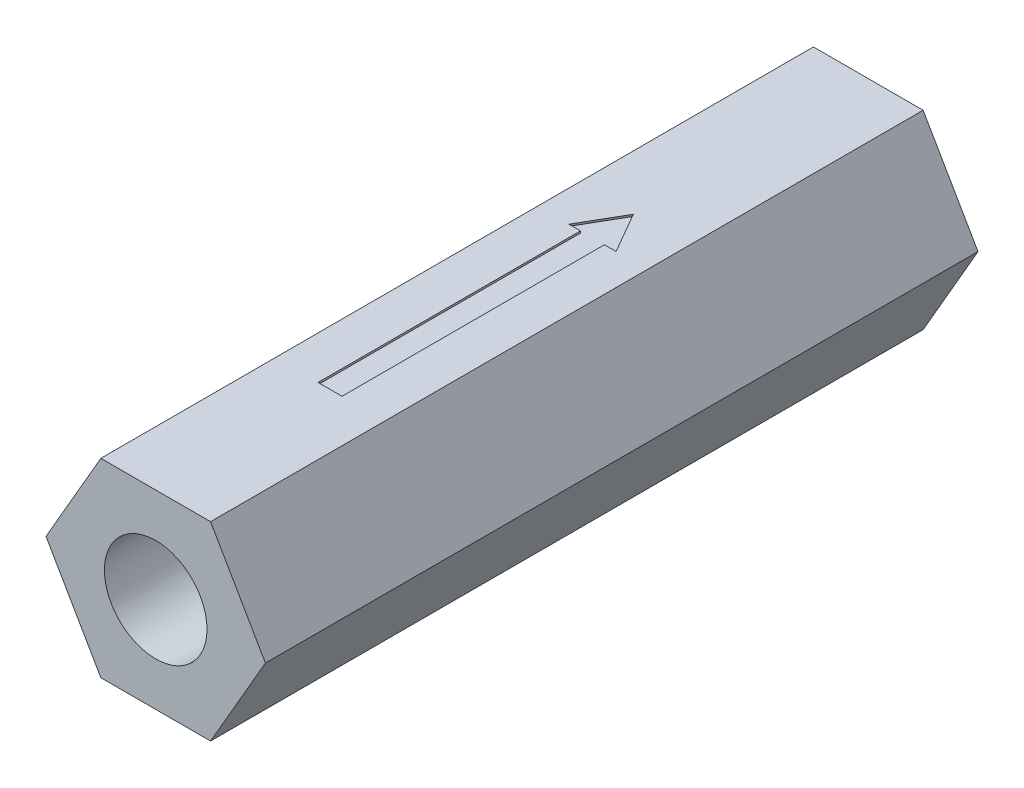
ISO-10303-21;
HEADER;
FILE_DESCRIPTION(('STEP AP214'),'2;1');
FILE_NAME('part.step','',(''),(''),'','','');
FILE_SCHEMA(('AUTOMOTIVE_DESIGN { 1 0 10303 214 1 1 1 1 }'));
ENDSEC;
DATA;
#1=APPLICATION_CONTEXT('core data for automotive mechanical design processes');
#2=APPLICATION_PROTOCOL_DEFINITION('international standard','automotive_design',2000,#1);
#3=PRODUCT_CONTEXT('',#1,'mechanical');
#4=PRODUCT('Part','Part','',(#3));
#5=PRODUCT_RELATED_PRODUCT_CATEGORY('part','',(#4));
#6=PRODUCT_DEFINITION_FORMATION('','',#4);
#7=PRODUCT_DEFINITION_CONTEXT('part definition',#1,'design');
#8=PRODUCT_DEFINITION('design','',#6,#7);
#9=PRODUCT_DEFINITION_SHAPE('','',#8);
#10=(LENGTH_UNIT() NAMED_UNIT(*) SI_UNIT(.MILLI.,.METRE.));
#11=(NAMED_UNIT(*) PLANE_ANGLE_UNIT() SI_UNIT($,.RADIAN.));
#12=(NAMED_UNIT(*) SI_UNIT($,.STERADIAN.) SOLID_ANGLE_UNIT());
#13=UNCERTAINTY_MEASURE_WITH_UNIT(LENGTH_MEASURE(1.E-05),#10,'distance_accuracy_value','');
#14=(GEOMETRIC_REPRESENTATION_CONTEXT(3) GLOBAL_UNCERTAINTY_ASSIGNED_CONTEXT((#13)) GLOBAL_UNIT_ASSIGNED_CONTEXT((#10,
#11,#12)) REPRESENTATION_CONTEXT('',''));
#15=CARTESIAN_POINT('',(0.,0.,0.));
#16=DIRECTION('',(0.,0.,1.));
#17=DIRECTION('',(1.,0.,0.));
#18=AXIS2_PLACEMENT_3D('',#15,#16,#17);
#19=CARTESIAN_POINT('',(7.3323484187084,-12.6999999999999,95.25));
#20=DIRECTION('',(-0.866025403784441,0.499999999999995,0.));
#21=DIRECTION('',(-0.499999999999995,-0.866025403784442,0.));
#22=AXIS2_PLACEMENT_3D('',#19,#20,#21);
#23=PLANE('',#22);
#24=DIRECTION('',(0.499999999999995,0.866025403784442,0.));
#25=VECTOR('',#24,1.);
#26=CARTESIAN_POINT('',(7.3323484187084,-12.6999999999999,0.));
#27=LINE('',#26,#25);
#28=CARTESIAN_POINT('',(7.3323484187084,-12.6999999999999,0.));
#29=VERTEX_POINT('',#28);
#30=CARTESIAN_POINT('',(14.6646968374165,0.,0.));
#31=VERTEX_POINT('',#30);
#32=EDGE_CURVE('E132',#29,#31,#27,.T.);
#33=ORIENTED_EDGE('',*,*,#32,.T.);
#34=DIRECTION('',(0.,0.,-1.));
#35=VECTOR('',#34,1.);
#36=CARTESIAN_POINT('',(14.6646968374165,0.,95.25));
#37=LINE('',#36,#35);
#38=CARTESIAN_POINT('',(14.6646968374165,0.,95.25));
#39=VERTEX_POINT('',#38);
#40=EDGE_CURVE('E11',#39,#31,#37,.T.);
#41=ORIENTED_EDGE('',*,*,#40,.F.);
#42=DIRECTION('',(0.499999999999995,0.866025403784442,0.));
#43=VECTOR('',#42,1.);
#44=CARTESIAN_POINT('',(7.3323484187084,-12.6999999999999,95.25));
#45=LINE('',#44,#43);
#46=CARTESIAN_POINT('',(7.3323484187084,-12.6999999999999,95.25));
#47=VERTEX_POINT('',#46);
#48=EDGE_CURVE('E144',#47,#39,#45,.T.);
#49=ORIENTED_EDGE('',*,*,#48,.F.);
#50=DIRECTION('',(0.,0.,-1.));
#51=VECTOR('',#50,1.);
#52=CARTESIAN_POINT('',(7.3323484187084,-12.6999999999999,95.25));
#53=LINE('',#52,#51);
#54=EDGE_CURVE('E128',#47,#29,#53,.T.);
#55=ORIENTED_EDGE('',*,*,#54,.T.);
#56=EDGE_LOOP('',(#33,#41,#49,#55));
#57=FACE_BOUND('',#56,.T.);
#58=ADVANCED_FACE('F36',(#57),#23,.F.);
#59=CARTESIAN_POINT('',(14.6646968374165,0.,95.25));
#60=DIRECTION('',(-0.866025403784438,-0.500000000000001,0.));
#61=DIRECTION('',(0.500000000000001,-0.866025403784438,0.));
#62=AXIS2_PLACEMENT_3D('',#59,#60,#61);
#63=PLANE('',#62);
#64=DIRECTION('',(-0.500000000000001,0.866025403784438,0.));
#65=VECTOR('',#64,1.);
#66=CARTESIAN_POINT('',(14.6646968374165,0.,0.));
#67=LINE('',#66,#65);
#68=CARTESIAN_POINT('',(7.33234841870822,12.7,0.));
#69=VERTEX_POINT('',#68);
#70=EDGE_CURVE('E135',#31,#69,#67,.T.);
#71=ORIENTED_EDGE('',*,*,#70,.T.);
#72=DIRECTION('',(0.,0.,-1.));
#73=VECTOR('',#72,1.);
#74=CARTESIAN_POINT('',(7.33234841870822,12.7,95.25));
#75=LINE('',#74,#73);
#76=CARTESIAN_POINT('',(7.33234841870822,12.7,95.25));
#77=VERTEX_POINT('',#76);
#78=EDGE_CURVE('E43',#77,#69,#75,.T.);
#79=ORIENTED_EDGE('',*,*,#78,.F.);
#80=DIRECTION('',(-0.500000000000001,0.866025403784438,0.));
#81=VECTOR('',#80,1.);
#82=CARTESIAN_POINT('',(14.6646968374165,0.,95.25));
#83=LINE('',#82,#81);
#84=EDGE_CURVE('E94',#39,#77,#83,.T.);
#85=ORIENTED_EDGE('',*,*,#84,.F.);
#86=ORIENTED_EDGE('',*,*,#40,.T.);
#87=EDGE_LOOP('',(#71,#79,#85,#86));
#88=FACE_BOUND('',#87,.T.);
#89=ADVANCED_FACE('F296',(#88),#63,.F.);
#90=CARTESIAN_POINT('',(7.33234841870822,12.7,95.25));
#91=DIRECTION('',(0.,-1.,0.));
#92=DIRECTION('',(1.,0.,0.));
#93=AXIS2_PLACEMENT_3D('',#90,#91,#92);
#94=PLANE('',#93);
#95=DIRECTION('',(0.,0.,1.));
#96=VECTOR('',#95,1.);
#97=CARTESIAN_POINT('',(-1.60045154196813,12.7,71.9490671710865));
#98=LINE('',#97,#96);
#99=CARTESIAN_POINT('',(-1.60045154196813,12.7,36.8665670362898));
#100=VERTEX_POINT('',#99);
#101=CARTESIAN_POINT('',(-1.60045154196813,12.7,71.9490671710865));
#102=VERTEX_POINT('',#101);
#103=EDGE_CURVE('E208',#100,#102,#98,.T.);
#104=ORIENTED_EDGE('',*,*,#103,.F.);
#105=DIRECTION('',(1.,0.,0.));
#106=VECTOR('',#105,1.);
#107=CARTESIAN_POINT('',(-3.153270171135,12.7,36.8665670362898));
#108=LINE('',#107,#106);
#109=CARTESIAN_POINT('',(-3.153270171135,12.7,36.8665670362898));
#110=VERTEX_POINT('',#109);
#111=EDGE_CURVE('E50',#110,#100,#108,.T.);
#112=ORIENTED_EDGE('',*,*,#111,.F.);
#113=DIRECTION('',(-0.499999999999998,0.,0.86602540378444));
#114=VECTOR('',#113,1.);
#115=CARTESIAN_POINT('',(0.,12.7,31.4049428898926));
#116=LINE('',#115,#114);
#117=CARTESIAN_POINT('',(0.,12.7,31.4049428898926));
#118=VERTEX_POINT('',#117);
#119=EDGE_CURVE('E192',#118,#110,#116,.T.);
#120=ORIENTED_EDGE('',*,*,#119,.F.);
#121=DIRECTION('',(-0.500000000000004,0.,-0.866025403784436));
#122=VECTOR('',#121,1.);
#123=CARTESIAN_POINT('',(3.15327017113494,12.7,36.8665670362897));
#124=LINE('',#123,#122);
#125=CARTESIAN_POINT('',(3.15327017113494,12.7,36.8665670362897));
#126=VERTEX_POINT('',#125);
#127=EDGE_CURVE('E196',#126,#118,#124,.T.);
#128=ORIENTED_EDGE('',*,*,#127,.F.);
#129=DIRECTION('',(1.,0.,0.));
#130=VECTOR('',#129,1.);
#131=CARTESIAN_POINT('',(1.60045154196804,12.7,36.8665670362897));
#132=LINE('',#131,#130);
#133=CARTESIAN_POINT('',(1.60045154196804,12.7,36.8665670362897));
#134=VERTEX_POINT('',#133);
#135=EDGE_CURVE('E199',#134,#126,#132,.T.);
#136=ORIENTED_EDGE('',*,*,#135,.F.);
#137=DIRECTION('',(0.,0.,-1.));
#138=VECTOR('',#137,1.);
#139=CARTESIAN_POINT('',(1.60045154196804,12.7,71.9490671710865));
#140=LINE('',#139,#138);
#141=CARTESIAN_POINT('',(1.60045154196804,12.7,71.9490671710865));
#142=VERTEX_POINT('',#141);
#143=EDGE_CURVE('E202',#142,#134,#140,.T.);
#144=ORIENTED_EDGE('',*,*,#143,.F.);
#145=DIRECTION('',(1.,0.,0.));
#146=VECTOR('',#145,1.);
#147=CARTESIAN_POINT('',(-1.60045154196813,12.7,71.9490671710865));
#148=LINE('',#147,#146);
#149=EDGE_CURVE('E205',#102,#142,#148,.T.);
#150=ORIENTED_EDGE('',*,*,#149,.F.);
#151=EDGE_LOOP('',(#104,#112,#120,#128,#136,#144,#150));
#152=FACE_BOUND('',#151,.T.);
#153=DIRECTION('',(-1.,0.,0.));
#154=VECTOR('',#153,1.);
#155=CARTESIAN_POINT('',(7.33234841870822,12.7,0.));
#156=LINE('',#155,#154);
#157=CARTESIAN_POINT('',(-7.33234841870831,12.7,0.));
#158=VERTEX_POINT('',#157);
#159=EDGE_CURVE('E138',#69,#158,#156,.T.);
#160=ORIENTED_EDGE('',*,*,#159,.T.);
#161=DIRECTION('',(0.,0.,-1.));
#162=VECTOR('',#161,1.);
#163=CARTESIAN_POINT('',(-7.33234841870831,12.7,95.25));
#164=LINE('',#163,#162);
#165=CARTESIAN_POINT('',(-7.33234841870831,12.7,95.25));
#166=VERTEX_POINT('',#165);
#167=EDGE_CURVE('E123',#166,#158,#164,.T.);
#168=ORIENTED_EDGE('',*,*,#167,.F.);
#169=DIRECTION('',(-1.,0.,0.));
#170=VECTOR('',#169,1.);
#171=CARTESIAN_POINT('',(7.33234841870822,12.7,95.25));
#172=LINE('',#171,#170);
#173=EDGE_CURVE('E111',#77,#166,#172,.T.);
#174=ORIENTED_EDGE('',*,*,#173,.F.);
#175=ORIENTED_EDGE('',*,*,#78,.T.);
#176=EDGE_LOOP('',(#160,#168,#174,#175));
#177=FACE_BOUND('',#176,.T.);
#178=ADVANCED_FACE('F150',(#152,#177),#94,.F.);
#179=CARTESIAN_POINT('',(-7.33234841870831,12.7,95.25));
#180=DIRECTION('',(0.866025403784441,-0.499999999999995,0.));
#181=DIRECTION('',(0.499999999999995,0.866025403784441,0.));
#182=AXIS2_PLACEMENT_3D('',#179,#180,#181);
#183=PLANE('',#182);
#184=DIRECTION('',(-0.499999999999995,-0.866025403784441,0.));
#185=VECTOR('',#184,1.);
#186=CARTESIAN_POINT('',(-7.33234841870831,12.7,0.));
#187=LINE('',#186,#185);
#188=CARTESIAN_POINT('',(-14.6646968374165,-1.02403030695263E-13,0.));
#189=VERTEX_POINT('',#188);
#190=EDGE_CURVE('E120',#158,#189,#187,.T.);
#191=ORIENTED_EDGE('',*,*,#190,.T.);
#192=DIRECTION('',(0.,0.,-1.));
#193=VECTOR('',#192,1.);
#194=CARTESIAN_POINT('',(-14.6646968374165,-1.02403030695263E-13,95.25));
#195=LINE('',#194,#193);
#196=CARTESIAN_POINT('',(-14.6646968374165,-1.02403030695263E-13,95.25));
#197=VERTEX_POINT('',#196);
#198=EDGE_CURVE('E117',#197,#189,#195,.T.);
#199=ORIENTED_EDGE('',*,*,#198,.F.);
#200=DIRECTION('',(-0.499999999999995,-0.866025403784441,0.));
#201=VECTOR('',#200,1.);
#202=CARTESIAN_POINT('',(-7.33234841870831,12.7,95.25));
#203=LINE('',#202,#201);
#204=EDGE_CURVE('E104',#166,#197,#203,.T.);
#205=ORIENTED_EDGE('',*,*,#204,.F.);
#206=ORIENTED_EDGE('',*,*,#167,.T.);
#207=EDGE_LOOP('',(#191,#199,#205,#206));
#208=FACE_BOUND('',#207,.T.);
#209=ADVANCED_FACE('F118',(#208),#183,.F.);
#210=CARTESIAN_POINT('',(-14.6646968374165,-1.02403030695263E-13,95.25));
#211=DIRECTION('',(0.866025403784434,0.500000000000007,0.));
#212=DIRECTION('',(-0.500000000000007,0.866025403784435,0.));
#213=AXIS2_PLACEMENT_3D('',#210,#211,#212);
#214=PLANE('',#213);
#215=DIRECTION('',(0.500000000000007,-0.866025403784435,0.));
#216=VECTOR('',#215,1.);
#217=CARTESIAN_POINT('',(-14.6646968374165,-1.02403030695263E-13,0.));
#218=LINE('',#217,#216);
#219=CARTESIAN_POINT('',(-7.33234841870814,-12.7000000000001,0.));
#220=VERTEX_POINT('',#219);
#221=EDGE_CURVE('E141',#189,#220,#218,.T.);
#222=ORIENTED_EDGE('',*,*,#221,.T.);
#223=DIRECTION('',(0.,0.,-1.));
#224=VECTOR('',#223,1.);
#225=CARTESIAN_POINT('',(-7.33234841870814,-12.7000000000001,95.25));
#226=LINE('',#225,#224);
#227=CARTESIAN_POINT('',(-7.33234841870814,-12.7000000000001,95.25));
#228=VERTEX_POINT('',#227);
#229=EDGE_CURVE('E124',#228,#220,#226,.T.);
#230=ORIENTED_EDGE('',*,*,#229,.F.);
#231=DIRECTION('',(0.500000000000007,-0.866025403784435,0.));
#232=VECTOR('',#231,1.);
#233=CARTESIAN_POINT('',(-14.6646968374165,-1.02403030695263E-13,95.25));
#234=LINE('',#233,#232);
#235=EDGE_CURVE('E108',#197,#228,#234,.T.);
#236=ORIENTED_EDGE('',*,*,#235,.F.);
#237=ORIENTED_EDGE('',*,*,#198,.T.);
#238=EDGE_LOOP('',(#222,#230,#236,#237));
#239=FACE_BOUND('',#238,.T.);
#240=ADVANCED_FACE('F126',(#239),#214,.F.);
#241=CARTESIAN_POINT('',(-7.33234841870814,-12.7000000000001,95.25));
#242=DIRECTION('',(0.,1.,0.));
#243=DIRECTION('',(-1.,0.,0.));
#244=AXIS2_PLACEMENT_3D('',#241,#242,#243);
#245=PLANE('',#244);
#246=DIRECTION('',(1.,0.,0.));
#247=VECTOR('',#246,1.);
#248=CARTESIAN_POINT('',(-7.33234841870814,-12.7000000000001,0.));
#249=LINE('',#248,#247);
#250=EDGE_CURVE('E86',#220,#29,#249,.T.);
#251=ORIENTED_EDGE('',*,*,#250,.T.);
#252=ORIENTED_EDGE('',*,*,#54,.F.);
#253=DIRECTION('',(1.,0.,0.));
#254=VECTOR('',#253,1.);
#255=CARTESIAN_POINT('',(-7.33234841870814,-12.7000000000001,95.25));
#256=LINE('',#255,#254);
#257=EDGE_CURVE('E59',#228,#47,#256,.T.);
#258=ORIENTED_EDGE('',*,*,#257,.F.);
#259=ORIENTED_EDGE('',*,*,#229,.T.);
#260=EDGE_LOOP('',(#251,#252,#258,#259));
#261=FACE_BOUND('',#260,.T.);
#262=ADVANCED_FACE('F154',(#261),#245,.F.);
#263=CARTESIAN_POINT('',(0.,0.,95.25));
#264=DIRECTION('',(0.,0.,1.));
#265=DIRECTION('',(1.,0.,0.));
#266=AXIS2_PLACEMENT_3D('',#263,#264,#265);
#267=PLANE('',#266);
#268=CARTESIAN_POINT('',(0.,0.,95.25));
#269=DIRECTION('',(0.,0.,1.));
#270=DIRECTION('',(1.,0.,0.));
#271=AXIS2_PLACEMENT_3D('',#268,#269,#270);
#272=CIRCLE('',#271,6.858);
#273=CARTESIAN_POINT('',(6.858,0.,95.25));
#274=VERTEX_POINT('',#273);
#275=EDGE_CURVE('E161',#274,#274,#272,.T.);
#276=ORIENTED_EDGE('',*,*,#275,.F.);
#277=EDGE_LOOP('',(#276));
#278=FACE_BOUND('',#277,.T.);
#279=ORIENTED_EDGE('',*,*,#48,.T.);
#280=ORIENTED_EDGE('',*,*,#84,.T.);
#281=ORIENTED_EDGE('',*,*,#173,.T.);
#282=ORIENTED_EDGE('',*,*,#204,.T.);
#283=ORIENTED_EDGE('',*,*,#235,.T.);
#284=ORIENTED_EDGE('',*,*,#257,.T.);
#285=EDGE_LOOP('',(#279,#280,#281,#282,#283,#284));
#286=FACE_BOUND('',#285,.T.);
#287=ADVANCED_FACE('F106',(#278,#286),#267,.T.);
#288=CARTESIAN_POINT('',(0.,0.,0.));
#289=DIRECTION('',(0.,0.,1.));
#290=DIRECTION('',(1.,0.,0.));
#291=AXIS2_PLACEMENT_3D('',#288,#289,#290);
#292=PLANE('',#291);
#293=CARTESIAN_POINT('',(0.,0.,0.));
#294=DIRECTION('',(0.,0.,-1.));
#295=DIRECTION('',(-1.,0.,0.));
#296=AXIS2_PLACEMENT_3D('',#293,#294,#295);
#297=CIRCLE('',#296,6.858);
#298=CARTESIAN_POINT('',(-6.858,0.,0.));
#299=VERTEX_POINT('',#298);
#300=EDGE_CURVE('E167',#299,#299,#297,.T.);
#301=ORIENTED_EDGE('',*,*,#300,.F.);
#302=EDGE_LOOP('',(#301));
#303=FACE_BOUND('',#302,.T.);
#304=ORIENTED_EDGE('',*,*,#32,.F.);
#305=ORIENTED_EDGE('',*,*,#250,.F.);
#306=ORIENTED_EDGE('',*,*,#221,.F.);
#307=ORIENTED_EDGE('',*,*,#190,.F.);
#308=ORIENTED_EDGE('',*,*,#159,.F.);
#309=ORIENTED_EDGE('',*,*,#70,.F.);
#310=EDGE_LOOP('',(#304,#305,#306,#307,#308,#309));
#311=FACE_BOUND('',#310,.T.);
#312=ADVANCED_FACE('F153',(#303,#311),#292,.F.);
#313=CARTESIAN_POINT('',(0.,0.,78.105));
#314=DIRECTION('',(0.,0.,1.));
#315=DIRECTION('',(1.,0.,0.));
#316=AXIS2_PLACEMENT_3D('',#313,#314,#315);
#317=CYLINDRICAL_SURFACE('',#316,6.858);
#318=CARTESIAN_POINT('',(0.,0.,78.105));
#319=DIRECTION('',(0.,0.,1.));
#320=DIRECTION('',(1.,0.,0.));
#321=AXIS2_PLACEMENT_3D('',#318,#319,#320);
#322=CIRCLE('',#321,6.858);
#323=CARTESIAN_POINT('',(6.858,0.,78.105));
#324=VERTEX_POINT('',#323);
#325=EDGE_CURVE('E136',#324,#324,#322,.T.);
#326=ORIENTED_EDGE('',*,*,#325,.F.);
#327=EDGE_LOOP('',(#326));
#328=FACE_BOUND('',#327,.T.);
#329=ORIENTED_EDGE('',*,*,#275,.T.);
#330=EDGE_LOOP('',(#329));
#331=FACE_BOUND('',#330,.T.);
#332=ADVANCED_FACE('F313',(#328,#331),#317,.F.);
#333=CARTESIAN_POINT('',(0.,0.,78.105));
#334=DIRECTION('',(0.,0.,1.));
#335=DIRECTION('',(1.,0.,0.));
#336=AXIS2_PLACEMENT_3D('',#333,#334,#335);
#337=PLANE('',#336);
#338=ORIENTED_EDGE('',*,*,#325,.T.);
#339=EDGE_LOOP('',(#338));
#340=FACE_BOUND('',#339,.T.);
#341=ADVANCED_FACE('F320',(#340),#337,.T.);
#342=CARTESIAN_POINT('',(0.,0.,17.145));
#343=DIRECTION('',(0.,0.,-1.));
#344=DIRECTION('',(-1.,0.,0.));
#345=AXIS2_PLACEMENT_3D('',#342,#343,#344);
#346=CYLINDRICAL_SURFACE('',#345,6.858);
#347=CARTESIAN_POINT('',(0.,0.,17.145));
#348=DIRECTION('',(0.,0.,-1.));
#349=DIRECTION('',(-1.,0.,0.));
#350=AXIS2_PLACEMENT_3D('',#347,#348,#349);
#351=CIRCLE('',#350,6.858);
#352=CARTESIAN_POINT('',(-6.858,0.,17.145));
#353=VERTEX_POINT('',#352);
#354=EDGE_CURVE('E164',#353,#353,#351,.T.);
#355=ORIENTED_EDGE('',*,*,#354,.F.);
#356=EDGE_LOOP('',(#355));
#357=FACE_BOUND('',#356,.T.);
#358=ORIENTED_EDGE('',*,*,#300,.T.);
#359=EDGE_LOOP('',(#358));
#360=FACE_BOUND('',#359,.T.);
#361=ADVANCED_FACE('F324',(#357,#360),#346,.F.);
#362=CARTESIAN_POINT('',(0.,0.,17.145));
#363=DIRECTION('',(0.,0.,-1.));
#364=DIRECTION('',(-1.,0.,0.));
#365=AXIS2_PLACEMENT_3D('',#362,#363,#364);
#366=PLANE('',#365);
#367=ORIENTED_EDGE('',*,*,#354,.T.);
#368=EDGE_LOOP('',(#367));
#369=FACE_BOUND('',#368,.T.);
#370=ADVANCED_FACE('F328',(#369),#366,.T.);
#371=CARTESIAN_POINT('',(-3.153270171135,12.446,36.8665670362898));
#372=DIRECTION('',(0.,0.,1.));
#373=DIRECTION('',(1.,0.,0.));
#374=AXIS2_PLACEMENT_3D('',#371,#372,#373);
#375=PLANE('',#374);
#376=ORIENTED_EDGE('',*,*,#111,.T.);
#377=DIRECTION('',(0.,1.,0.));
#378=VECTOR('',#377,1.);
#379=CARTESIAN_POINT('',(-1.60045154196813,12.446,36.8665670362898));
#380=LINE('',#379,#378);
#381=CARTESIAN_POINT('',(-1.60045154196813,12.446,36.8665670362898));
#382=VERTEX_POINT('',#381);
#383=EDGE_CURVE('E173',#382,#100,#380,.T.);
#384=ORIENTED_EDGE('',*,*,#383,.F.);
#385=DIRECTION('',(1.,0.,0.));
#386=VECTOR('',#385,1.);
#387=CARTESIAN_POINT('',(-3.153270171135,12.446,36.8665670362898));
#388=LINE('',#387,#386);
#389=CARTESIAN_POINT('',(-3.153270171135,12.446,36.8665670362898));
#390=VERTEX_POINT('',#389);
#391=EDGE_CURVE('E195',#390,#382,#388,.T.);
#392=ORIENTED_EDGE('',*,*,#391,.F.);
#393=DIRECTION('',(0.,1.,0.));
#394=VECTOR('',#393,1.);
#395=CARTESIAN_POINT('',(-3.153270171135,12.446,36.8665670362898));
#396=LINE('',#395,#394);
#397=EDGE_CURVE('E170',#390,#110,#396,.T.);
#398=ORIENTED_EDGE('',*,*,#397,.T.);
#399=EDGE_LOOP('',(#376,#384,#392,#398));
#400=FACE_BOUND('',#399,.T.);
#401=ADVANCED_FACE('F239',(#400),#375,.F.);
#402=CARTESIAN_POINT('',(0.,12.446,31.4049428898926));
#403=DIRECTION('',(-0.86602540378444,0.,-0.499999999999998));
#404=DIRECTION('',(-0.499999999999998,0.,0.86602540378444));
#405=AXIS2_PLACEMENT_3D('',#402,#403,#404);
#406=PLANE('',#405);
#407=ORIENTED_EDGE('',*,*,#119,.T.);
#408=ORIENTED_EDGE('',*,*,#397,.F.);
#409=DIRECTION('',(-0.499999999999998,0.,0.86602540378444));
#410=VECTOR('',#409,1.);
#411=CARTESIAN_POINT('',(0.,12.446,31.4049428898926));
#412=LINE('',#411,#410);
#413=CARTESIAN_POINT('',(0.,12.446,31.4049428898926));
#414=VERTEX_POINT('',#413);
#415=EDGE_CURVE('E176',#414,#390,#412,.T.);
#416=ORIENTED_EDGE('',*,*,#415,.F.);
#417=DIRECTION('',(0.,1.,0.));
#418=VECTOR('',#417,1.);
#419=CARTESIAN_POINT('',(0.,12.446,31.4049428898926));
#420=LINE('',#419,#418);
#421=EDGE_CURVE('E188',#414,#118,#420,.T.);
#422=ORIENTED_EDGE('',*,*,#421,.T.);
#423=EDGE_LOOP('',(#407,#408,#416,#422));
#424=FACE_BOUND('',#423,.T.);
#425=ADVANCED_FACE('F257',(#424),#406,.F.);
#426=CARTESIAN_POINT('',(3.15327017113494,12.446,36.8665670362897));
#427=DIRECTION('',(0.866025403784436,0.,-0.500000000000004));
#428=DIRECTION('',(-0.500000000000004,0.,-0.866025403784436));
#429=AXIS2_PLACEMENT_3D('',#426,#427,#428);
#430=PLANE('',#429);
#431=ORIENTED_EDGE('',*,*,#127,.T.);
#432=ORIENTED_EDGE('',*,*,#421,.F.);
#433=DIRECTION('',(-0.500000000000004,0.,-0.866025403784436));
#434=VECTOR('',#433,1.);
#435=CARTESIAN_POINT('',(3.15327017113494,12.446,36.8665670362897));
#436=LINE('',#435,#434);
#437=CARTESIAN_POINT('',(3.15327017113494,12.446,36.8665670362897));
#438=VERTEX_POINT('',#437);
#439=EDGE_CURVE('E214',#438,#414,#436,.T.);
#440=ORIENTED_EDGE('',*,*,#439,.F.);
#441=DIRECTION('',(0.,1.,0.));
#442=VECTOR('',#441,1.);
#443=CARTESIAN_POINT('',(3.15327017113494,12.446,36.8665670362897));
#444=LINE('',#443,#442);
#445=EDGE_CURVE('E185',#438,#126,#444,.T.);
#446=ORIENTED_EDGE('',*,*,#445,.T.);
#447=EDGE_LOOP('',(#431,#432,#440,#446));
#448=FACE_BOUND('',#447,.T.);
#449=ADVANCED_FACE('F262',(#448),#430,.F.);
#450=CARTESIAN_POINT('',(1.60045154196804,12.446,36.8665670362897));
#451=DIRECTION('',(0.,0.,1.));
#452=DIRECTION('',(1.,0.,0.));
#453=AXIS2_PLACEMENT_3D('',#450,#451,#452);
#454=PLANE('',#453);
#455=ORIENTED_EDGE('',*,*,#135,.T.);
#456=ORIENTED_EDGE('',*,*,#445,.F.);
#457=DIRECTION('',(1.,0.,0.));
#458=VECTOR('',#457,1.);
#459=CARTESIAN_POINT('',(1.60045154196804,12.446,36.8665670362897));
#460=LINE('',#459,#458);
#461=CARTESIAN_POINT('',(1.60045154196804,12.446,36.8665670362897));
#462=VERTEX_POINT('',#461);
#463=EDGE_CURVE('E217',#462,#438,#460,.T.);
#464=ORIENTED_EDGE('',*,*,#463,.F.);
#465=DIRECTION('',(0.,1.,0.));
#466=VECTOR('',#465,1.);
#467=CARTESIAN_POINT('',(1.60045154196804,12.446,36.8665670362897));
#468=LINE('',#467,#466);
#469=EDGE_CURVE('E182',#462,#134,#468,.T.);
#470=ORIENTED_EDGE('',*,*,#469,.T.);
#471=EDGE_LOOP('',(#455,#456,#464,#470));
#472=FACE_BOUND('',#471,.T.);
#473=ADVANCED_FACE('F284',(#472),#454,.F.);
#474=CARTESIAN_POINT('',(1.60045154196804,12.446,71.9490671710865));
#475=DIRECTION('',(1.,0.,0.));
#476=DIRECTION('',(0.,1.,0.));
#477=AXIS2_PLACEMENT_3D('',#474,#475,#476);
#478=PLANE('',#477);
#479=ORIENTED_EDGE('',*,*,#143,.T.);
#480=ORIENTED_EDGE('',*,*,#469,.F.);
#481=DIRECTION('',(0.,0.,-1.));
#482=VECTOR('',#481,1.);
#483=CARTESIAN_POINT('',(1.60045154196804,12.446,71.9490671710865));
#484=LINE('',#483,#482);
#485=CARTESIAN_POINT('',(1.60045154196804,12.446,71.9490671710865));
#486=VERTEX_POINT('',#485);
#487=EDGE_CURVE('E220',#486,#462,#484,.T.);
#488=ORIENTED_EDGE('',*,*,#487,.F.);
#489=DIRECTION('',(0.,1.,0.));
#490=VECTOR('',#489,1.);
#491=CARTESIAN_POINT('',(1.60045154196804,12.446,71.9490671710865));
#492=LINE('',#491,#490);
#493=EDGE_CURVE('E179',#486,#142,#492,.T.);
#494=ORIENTED_EDGE('',*,*,#493,.T.);
#495=EDGE_LOOP('',(#479,#480,#488,#494));
#496=FACE_BOUND('',#495,.T.);
#497=ADVANCED_FACE('F286',(#496),#478,.F.);
#498=CARTESIAN_POINT('',(-1.60045154196813,12.446,71.9490671710865));
#499=DIRECTION('',(0.,0.,1.));
#500=DIRECTION('',(1.,0.,0.));
#501=AXIS2_PLACEMENT_3D('',#498,#499,#500);
#502=PLANE('',#501);
#503=ORIENTED_EDGE('',*,*,#149,.T.);
#504=ORIENTED_EDGE('',*,*,#493,.F.);
#505=DIRECTION('',(1.,0.,0.));
#506=VECTOR('',#505,1.);
#507=CARTESIAN_POINT('',(-1.60045154196813,12.446,71.9490671710865));
#508=LINE('',#507,#506);
#509=CARTESIAN_POINT('',(-1.60045154196813,12.446,71.9490671710865));
#510=VERTEX_POINT('',#509);
#511=EDGE_CURVE('E223',#510,#486,#508,.T.);
#512=ORIENTED_EDGE('',*,*,#511,.F.);
#513=DIRECTION('',(0.,1.,0.));
#514=VECTOR('',#513,1.);
#515=CARTESIAN_POINT('',(-1.60045154196813,12.446,71.9490671710865));
#516=LINE('',#515,#514);
#517=EDGE_CURVE('E175',#510,#102,#516,.T.);
#518=ORIENTED_EDGE('',*,*,#517,.T.);
#519=EDGE_LOOP('',(#503,#504,#512,#518));
#520=FACE_BOUND('',#519,.T.);
#521=ADVANCED_FACE('F276',(#520),#502,.F.);
#522=CARTESIAN_POINT('',(-1.60045154196813,12.446,71.9490671710865));
#523=DIRECTION('',(-1.,0.,0.));
#524=DIRECTION('',(0.,-1.,0.));
#525=AXIS2_PLACEMENT_3D('',#522,#523,#524);
#526=PLANE('',#525);
#527=ORIENTED_EDGE('',*,*,#103,.T.);
#528=ORIENTED_EDGE('',*,*,#517,.F.);
#529=DIRECTION('',(0.,0.,1.));
#530=VECTOR('',#529,1.);
#531=CARTESIAN_POINT('',(-1.60045154196813,12.446,42.1963292255612));
#532=LINE('',#531,#530);
#533=EDGE_CURVE('E226',#382,#510,#532,.T.);
#534=ORIENTED_EDGE('',*,*,#533,.F.);
#535=ORIENTED_EDGE('',*,*,#383,.T.);
#536=EDGE_LOOP('',(#527,#528,#534,#535));
#537=FACE_BOUND('',#536,.T.);
#538=ADVANCED_FACE('F270',(#537),#526,.F.);
#539=CARTESIAN_POINT('',(0.,12.446,0.));
#540=DIRECTION('',(0.,1.,0.));
#541=DIRECTION('',(-1.,0.,0.));
#542=AXIS2_PLACEMENT_3D('',#539,#540,#541);
#543=PLANE('',#542);
#544=ORIENTED_EDGE('',*,*,#391,.T.);
#545=ORIENTED_EDGE('',*,*,#533,.T.);
#546=ORIENTED_EDGE('',*,*,#511,.T.);
#547=ORIENTED_EDGE('',*,*,#487,.T.);
#548=ORIENTED_EDGE('',*,*,#463,.T.);
#549=ORIENTED_EDGE('',*,*,#439,.T.);
#550=ORIENTED_EDGE('',*,*,#415,.T.);
#551=EDGE_LOOP('',(#544,#545,#546,#547,#548,#549,#550));
#552=FACE_BOUND('',#551,.T.);
#553=ADVANCED_FACE('F233',(#552),#543,.T.);
#554=CLOSED_SHELL('',(#58,#89,#178,#209,#240,#262,#287,#312,#332,#341,#361,#370,#401,#425,#449,
#473,#497,#521,#538,#553));
#555=MANIFOLD_SOLID_BREP('B2',#554);
#556=ADVANCED_BREP_SHAPE_REPRESENTATION('',(#18,#555),#14);
#557=SHAPE_DEFINITION_REPRESENTATION(#9,#556);
ENDSEC;
END-ISO-10303-21;
